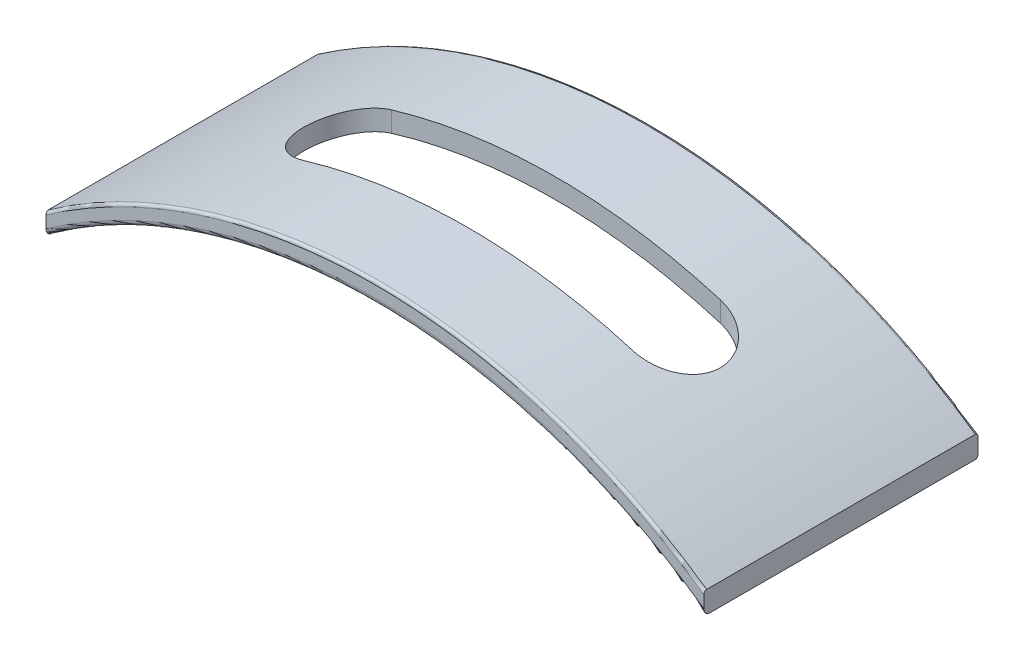
ISO-10303-21;
HEADER;
FILE_DESCRIPTION(('STEP AP214'),'2;1');
FILE_NAME('part.step','',(''),(''),'','','');
FILE_SCHEMA(('AUTOMOTIVE_DESIGN { 1 0 10303 214 1 1 1 1 }'));
ENDSEC;
DATA;
#1=APPLICATION_CONTEXT('core data for automotive mechanical design processes');
#2=APPLICATION_PROTOCOL_DEFINITION('international standard','automotive_design',2000,#1);
#3=PRODUCT_CONTEXT('',#1,'mechanical');
#4=PRODUCT('Part','Part','',(#3));
#5=PRODUCT_RELATED_PRODUCT_CATEGORY('part','',(#4));
#6=PRODUCT_DEFINITION_FORMATION('','',#4);
#7=PRODUCT_DEFINITION_CONTEXT('part definition',#1,'design');
#8=PRODUCT_DEFINITION('design','',#6,#7);
#9=PRODUCT_DEFINITION_SHAPE('','',#8);
#10=(LENGTH_UNIT() NAMED_UNIT(*) SI_UNIT(.MILLI.,.METRE.));
#11=(NAMED_UNIT(*) PLANE_ANGLE_UNIT() SI_UNIT($,.RADIAN.));
#12=(NAMED_UNIT(*) SI_UNIT($,.STERADIAN.) SOLID_ANGLE_UNIT());
#13=UNCERTAINTY_MEASURE_WITH_UNIT(LENGTH_MEASURE(1.E-05),#10,'distance_accuracy_value','');
#14=(GEOMETRIC_REPRESENTATION_CONTEXT(3) GLOBAL_UNCERTAINTY_ASSIGNED_CONTEXT((#13)) GLOBAL_UNIT_ASSIGNED_CONTEXT((#10,
#11,#12)) REPRESENTATION_CONTEXT('',''));
#15=CARTESIAN_POINT('',(0.,0.,0.));
#16=DIRECTION('',(0.,0.,1.));
#17=DIRECTION('',(1.,0.,0.));
#18=AXIS2_PLACEMENT_3D('',#15,#16,#17);
#19=CARTESIAN_POINT('',(0.,-43.9013111687743,25.));
#20=DIRECTION('',(0.,0.,-1.));
#21=DIRECTION('',(-1.,0.,0.));
#22=AXIS2_PLACEMENT_3D('',#19,#20,#21);
#23=CYLINDRICAL_SURFACE('',#22,51.5336771214945);
#24=DIRECTION('',(0.,0.,-1.));
#25=VECTOR('',#24,1.);
#26=CARTESIAN_POINT('',(-30.,-2.,25.));
#27=LINE('',#26,#25);
#28=CARTESIAN_POINT('',(-30.,-2.,24.5));
#29=VERTEX_POINT('',#28);
#30=CARTESIAN_POINT('',(-30.,-2.,0.25));
#31=VERTEX_POINT('',#30);
#32=EDGE_CURVE('E299',#29,#31,#27,.T.);
#33=ORIENTED_EDGE('',*,*,#32,.T.);
#34=CARTESIAN_POINT('',(0.,-43.9013111687743,0.25));
#35=DIRECTION('',(0.,0.,-1.));
#36=DIRECTION('',(-1.,0.,0.));
#37=AXIS2_PLACEMENT_3D('',#34,#35,#36);
#38=CIRCLE('',#37,51.5336771214945);
#39=CARTESIAN_POINT('',(30.,-2.,0.25));
#40=VERTEX_POINT('',#39);
#41=EDGE_CURVE('E261',#31,#40,#38,.T.);
#42=ORIENTED_EDGE('',*,*,#41,.T.);
#43=DIRECTION('',(0.,0.,-1.));
#44=VECTOR('',#43,1.);
#45=CARTESIAN_POINT('',(30.,-2.,25.));
#46=LINE('',#45,#44);
#47=CARTESIAN_POINT('',(30.,-2.,24.5));
#48=VERTEX_POINT('',#47);
#49=EDGE_CURVE('E302',#48,#40,#46,.T.);
#50=ORIENTED_EDGE('',*,*,#49,.F.);
#51=CARTESIAN_POINT('',(0.,-43.9013111687743,24.5));
#52=DIRECTION('',(0.,0.,-1.));
#53=DIRECTION('',(-1.,0.,0.));
#54=AXIS2_PLACEMENT_3D('',#51,#52,#53);
#55=CIRCLE('',#54,51.5336771214945);
#56=EDGE_CURVE('E269',#48,#29,#55,.F.);
#57=ORIENTED_EDGE('',*,*,#56,.T.);
#58=EDGE_LOOP('',(#33,#42,#50,#57));
#59=FACE_BOUND('',#58,.T.);
#60=CARTESIAN_POINT('',(-15.,5.40102019255637,16.5));
#61=CARTESIAN_POINT('',(-15.1179513128015,5.3651385071772,16.5000076195144));
#62=CARTESIAN_POINT('',(-15.2357618215816,5.32882841759186,16.4947828579675));
#63=CARTESIAN_POINT('',(-15.4702791286443,5.25563457535611,16.474000372818));
#64=CARTESIAN_POINT('',(-15.5869860102367,5.21875086657156,16.4584434355809));
#65=CARTESIAN_POINT('',(-15.8185034940739,5.14468375880668,16.4171263376553));
#66=CARTESIAN_POINT('',(-15.9333139095254,5.10750033083576,16.3913651780659));
#67=CARTESIAN_POINT('',(-16.1601979833847,5.03315686130002,16.3298528576106));
#68=CARTESIAN_POINT('',(-16.2722716276293,4.9959968198572,16.2941016450558));
#69=CARTESIAN_POINT('',(-16.6032999979632,4.88500068203661,16.1721429084369));
#70=CARTESIAN_POINT('',(-16.8171931041762,4.8116065393354,16.0712068043143));
#71=CARTESIAN_POINT('',(-17.2247623709842,4.6689905295129,15.8326034417193));
#72=CARTESIAN_POINT('',(-17.4184432375198,4.59976769279513,15.6949447598909));
#73=CARTESIAN_POINT('',(-17.7780067476244,4.46911982886023,15.387564087263));
#74=CARTESIAN_POINT('',(-17.944146618091,4.40762411776207,15.2181744780298));
#75=CARTESIAN_POINT('',(-18.2451571690101,4.29474720840848,14.8506043341167));
#76=CARTESIAN_POINT('',(-18.3800341696418,4.24336396610895,14.6524296319027));
#77=CARTESIAN_POINT('',(-18.6070102122771,4.15608277076029,14.2438980201352));
#78=CARTESIAN_POINT('',(-18.7009848538227,4.11951293215671,14.0347286389881));
#79=CARTESIAN_POINT('',(-18.8521275206658,4.06038012672537,13.6016502280125));
#80=CARTESIAN_POINT('',(-18.9093151677787,4.03780969298509,13.3777491263076));
#81=CARTESIAN_POINT('',(-18.9818675032768,4.00912610131467,12.9373395649319));
#82=CARTESIAN_POINT('',(-18.9997170536988,4.00203543949093,12.7213016234105));
#83=CARTESIAN_POINT('',(-19.0002760633806,4.00181399818526,12.2891930103569));
#84=CARTESIAN_POINT('',(-18.9829925271415,4.00868043606935,12.0731223539349));
#85=CARTESIAN_POINT('',(-18.9150935653052,4.03552599729484,11.6539763490636));
#86=CARTESIAN_POINT('',(-18.8655116303226,4.05509848535575,11.4507056478134));
#87=CARTESIAN_POINT('',(-18.7359243709711,4.10587394803192,11.0556683336362));
#88=CARTESIAN_POINT('',(-18.6559164976627,4.137077897071,10.8639026861063));
#89=CARTESIAN_POINT('',(-18.465931605464,4.21043189114839,10.4920191604687));
#90=CARTESIAN_POINT('',(-18.3552667325218,4.25283197633725,10.3123030817034));
#91=CARTESIAN_POINT('',(-18.1084548409614,4.3461873717434,9.97385523321495));
#92=CARTESIAN_POINT('',(-17.9723027945751,4.39714436974926,9.81512761437392));
#93=CARTESIAN_POINT('',(-17.669501132361,4.50877172270009,9.51299413064383));
#94=CARTESIAN_POINT('',(-17.5015117970534,4.56984143709118,9.37107902119877));
#95=CARTESIAN_POINT('',(-17.1457806904962,4.69681372299764,9.11718752515325));
#96=CARTESIAN_POINT('',(-16.9580264401537,4.7627193397341,9.00523021308318));
#97=CARTESIAN_POINT('',(-16.5560627902116,4.90098829826317,8.80788288806468));
#98=CARTESIAN_POINT('',(-16.3409463156995,4.97350329139957,8.72444816459542));
#99=CARTESIAN_POINT('',(-15.8998612232281,5.11876617057284,8.59578739251293));
#100=CARTESIAN_POINT('',(-15.6739084455045,5.19151357981918,8.550507267641));
#101=CARTESIAN_POINT('',(-15.3717473346871,5.28644494241938,8.51661317861545));
#102=CARTESIAN_POINT('',(-15.2975316331139,5.30957674865355,8.51038379551611));
#103=CARTESIAN_POINT('',(-15.1489041169419,5.3555319776657,8.50208246870267));
#104=CARTESIAN_POINT('',(-15.074492809668,5.37835583655531,8.50000385518851));
#105=CARTESIAN_POINT('',(-15.,5.40102019255637,8.5));
#106=B_SPLINE_CURVE_WITH_KNOTS('',3,(#60,#61,#62,#63,#64,#65,#66,#67,#68,#69,#70,#71,#72,#73,
#74,#75,#76,#77,#78,#79,#80,#81,#82,#83,#84,#85,#86,#87,#88,#89,#90,#91,#92,#93,#94,#95,#96,#97,
#98,#99,#100,#101,#102,#103,#104,#105),.UNSPECIFIED.,.F.,.F.,(4,2,2,2,2,2,2,2,2,2,2,2,2,2,2,2,2,
2,2,2,2,2,4),(0.,0.369737100535955,0.739446064196842,1.10919122796826,1.47893830485236,
2.21801914778329,2.9569275275475,3.68848964832294,4.41990374544917,5.11287996067117,
5.80548624213657,6.45291217951321,7.10020905191514,7.7277484990439,8.3553405300106,
8.9983479583802,9.64148236456199,10.3232054110685,11.0053614924422,11.7277321167672,
12.4490771997026,12.682955724327,12.9164581301917),.UNSPECIFIED.);
#107=CARTESIAN_POINT('',(-15.,5.40102019255637,16.5));
#108=VERTEX_POINT('',#107);
#109=CARTESIAN_POINT('',(-15.,5.40102019255637,8.5));
#110=VERTEX_POINT('',#109);
#111=EDGE_CURVE('E139',#108,#110,#106,.T.);
#112=ORIENTED_EDGE('',*,*,#111,.F.);
#113=CARTESIAN_POINT('',(0.,-43.9013111687743,16.5));
#114=DIRECTION('',(0.,0.,-1.));
#115=DIRECTION('',(-1.,0.,0.));
#116=AXIS2_PLACEMENT_3D('',#113,#114,#115);
#117=CIRCLE('',#116,51.5336771214945);
#118=CARTESIAN_POINT('',(15.,5.40102019255637,16.5));
#119=VERTEX_POINT('',#118);
#120=EDGE_CURVE('E174',#119,#108,#117,.F.);
#121=ORIENTED_EDGE('',*,*,#120,.F.);
#122=CARTESIAN_POINT('',(15.,5.40102019255637,8.5));
#123=CARTESIAN_POINT('',(15.1179513128014,5.3651385071772,8.49999238048558));
#124=CARTESIAN_POINT('',(15.2357618215816,5.32882841759186,8.50521714203254));
#125=CARTESIAN_POINT('',(15.4702791286443,5.25563457535612,8.52599962718201));
#126=CARTESIAN_POINT('',(15.5869860102367,5.21875086657156,8.54155656441915));
#127=CARTESIAN_POINT('',(15.8185034940739,5.14468375880668,8.58287366234468));
#128=CARTESIAN_POINT('',(15.9333139095254,5.10750033083576,8.60863482193413));
#129=CARTESIAN_POINT('',(16.1601979833847,5.03315686130002,8.67014714238941));
#130=CARTESIAN_POINT('',(16.2722716276293,4.99599681985721,8.70589835494421));
#131=CARTESIAN_POINT('',(16.6032999979632,4.88500068203661,8.82785709156315));
#132=CARTESIAN_POINT('',(16.8171931041762,4.8116065393354,8.9287931956857));
#133=CARTESIAN_POINT('',(17.2247623709842,4.6689905295129,9.16739655828067));
#134=CARTESIAN_POINT('',(17.4184432375198,4.59976769279513,9.30505524010911));
#135=CARTESIAN_POINT('',(17.7780067476244,4.46911982886023,9.61243591273701));
#136=CARTESIAN_POINT('',(17.944146618091,4.40762411776207,9.78182552197016));
#137=CARTESIAN_POINT('',(18.2451571690101,4.29474720840848,10.1493956658833));
#138=CARTESIAN_POINT('',(18.3800341696418,4.24336396610894,10.3475703680973));
#139=CARTESIAN_POINT('',(18.6070102122771,4.15608277076029,10.7561019798648));
#140=CARTESIAN_POINT('',(18.7009848538227,4.11951293215672,10.9652713610119));
#141=CARTESIAN_POINT('',(18.8521275206658,4.06038012672539,11.3983497719875));
#142=CARTESIAN_POINT('',(18.9093151677787,4.03780969298511,11.6222508736924));
#143=CARTESIAN_POINT('',(18.9818675032768,4.00912610131468,12.0626604350681));
#144=CARTESIAN_POINT('',(18.9997170536988,4.00203543949092,12.2786983765895));
#145=CARTESIAN_POINT('',(19.0002760633805,4.00181399818526,12.7108069896431));
#146=CARTESIAN_POINT('',(18.9829925271415,4.00868043606935,12.9268776460651));
#147=CARTESIAN_POINT('',(18.9150935653052,4.03552599729485,13.3460236509364));
#148=CARTESIAN_POINT('',(18.8655116303226,4.05509848535575,13.5492943521866));
#149=CARTESIAN_POINT('',(18.7359243709711,4.10587394803192,13.9443316663638));
#150=CARTESIAN_POINT('',(18.6559164976627,4.13707789707099,14.1360973138937));
#151=CARTESIAN_POINT('',(18.465931605464,4.21043189114839,14.5079808395313));
#152=CARTESIAN_POINT('',(18.3552667325218,4.25283197633725,14.6876969182966));
#153=CARTESIAN_POINT('',(18.1084548409614,4.3461873717434,15.0261447667851));
#154=CARTESIAN_POINT('',(17.9723027945751,4.39714436974925,15.1848723856261));
#155=CARTESIAN_POINT('',(17.669501132361,4.50877172270009,15.4870058693562));
#156=CARTESIAN_POINT('',(17.5015117970534,4.56984143709119,15.6289209788012));
#157=CARTESIAN_POINT('',(17.1457806904962,4.69681372299765,15.8828124748468));
#158=CARTESIAN_POINT('',(16.9580264401536,4.7627193397341,15.9947697869168));
#159=CARTESIAN_POINT('',(16.5560627902115,4.90098829826317,16.1921171119353));
#160=CARTESIAN_POINT('',(16.3409463156995,4.97350329139957,16.2755518354046));
#161=CARTESIAN_POINT('',(15.899861223228,5.11876617057285,16.4042126074871));
#162=CARTESIAN_POINT('',(15.6739084455045,5.1915135798192,16.449492732359));
#163=CARTESIAN_POINT('',(15.3717473346871,5.28644494241939,16.4833868213845));
#164=CARTESIAN_POINT('',(15.2975316331139,5.30957674865355,16.4896162044839));
#165=CARTESIAN_POINT('',(15.1489041169419,5.35553197766569,16.4979175312973));
#166=CARTESIAN_POINT('',(15.074492809668,5.37835583655531,16.4999961448115));
#167=CARTESIAN_POINT('',(15.,5.40102019255637,16.5));
#168=B_SPLINE_CURVE_WITH_KNOTS('',3,(#122,#123,#124,#125,#126,#127,#128,#129,#130,#131,#132,
#133,#134,#135,#136,#137,#138,#139,#140,#141,#142,#143,#144,#145,#146,#147,#148,#149,#150,#151,
#152,#153,#154,#155,#156,#157,#158,#159,#160,#161,#162,#163,#164,#165,#166,#167),.UNSPECIFIED.,
.F.,.F.,(4,2,2,2,2,2,2,2,2,2,2,2,2,2,2,2,2,2,2,2,2,2,4),(0.,0.369737100535957,0.739446064196845,
1.10919122796826,1.47893830485236,2.21801914778329,2.9569275275475,3.68848964832294,
4.41990374544917,5.11287996067117,5.80548624213658,6.45291217951322,7.10020905191514,
7.7277484990439,8.3553405300106,8.9983479583802,9.64148236456199,10.3232054110685,
11.0053614924422,11.7277321167672,12.4490771997026,12.682955724327,12.9164581301917),.UNSPECIFIED.);
#169=CARTESIAN_POINT('',(15.,5.40102019255637,8.5));
#170=VERTEX_POINT('',#169);
#171=EDGE_CURVE('E166',#170,#119,#168,.T.);
#172=ORIENTED_EDGE('',*,*,#171,.F.);
#173=CARTESIAN_POINT('',(0.,-43.9013111687743,8.5));
#174=DIRECTION('',(0.,0.,1.));
#175=DIRECTION('',(1.,0.,0.));
#176=AXIS2_PLACEMENT_3D('',#173,#174,#175);
#177=CIRCLE('',#176,51.5336771214945);
#178=EDGE_CURVE('E175',#110,#170,#177,.F.);
#179=ORIENTED_EDGE('',*,*,#178,.F.);
#180=EDGE_LOOP('',(#112,#121,#172,#179));
#181=FACE_BOUND('',#180,.T.);
#182=ADVANCED_FACE('F34',(#59,#181),#23,.F.);
#183=CARTESIAN_POINT('',(0.,-42.9013111687743,25.));
#184=DIRECTION('',(0.,0.,-1.));
#185=DIRECTION('',(-1.,0.,0.));
#186=AXIS2_PLACEMENT_3D('',#183,#184,#185);
#187=CYLINDRICAL_SURFACE('',#186,52.35);
#188=DIRECTION('',(0.,0.,-1.));
#189=VECTOR('',#188,1.);
#190=CARTESIAN_POINT('',(30.,0.,25.));
#191=LINE('',#190,#189);
#192=CARTESIAN_POINT('',(30.,0.,24.75));
#193=VERTEX_POINT('',#192);
#194=CARTESIAN_POINT('',(30.,0.,0.25));
#195=VERTEX_POINT('',#194);
#196=EDGE_CURVE('E305',#193,#195,#191,.T.);
#197=ORIENTED_EDGE('',*,*,#196,.T.);
#198=CARTESIAN_POINT('',(0.,-42.9013111687743,0.25));
#199=DIRECTION('',(0.,0.,-1.));
#200=DIRECTION('',(-1.,0.,0.));
#201=AXIS2_PLACEMENT_3D('',#198,#199,#200);
#202=CIRCLE('',#201,52.35);
#203=CARTESIAN_POINT('',(-30.,0.,0.25));
#204=VERTEX_POINT('',#203);
#205=EDGE_CURVE('E132',#195,#204,#202,.F.);
#206=ORIENTED_EDGE('',*,*,#205,.T.);
#207=DIRECTION('',(0.,0.,-1.));
#208=VECTOR('',#207,1.);
#209=CARTESIAN_POINT('',(-30.,0.,25.));
#210=LINE('',#209,#208);
#211=CARTESIAN_POINT('',(-30.,0.,24.75));
#212=VERTEX_POINT('',#211);
#213=EDGE_CURVE('E308',#212,#204,#210,.T.);
#214=ORIENTED_EDGE('',*,*,#213,.F.);
#215=CARTESIAN_POINT('',(0.,-42.9013111687743,24.75));
#216=DIRECTION('',(0.,0.,-1.));
#217=DIRECTION('',(-1.,0.,0.));
#218=AXIS2_PLACEMENT_3D('',#215,#216,#217);
#219=CIRCLE('',#218,52.35);
#220=EDGE_CURVE('E296',#212,#193,#219,.T.);
#221=ORIENTED_EDGE('',*,*,#220,.T.);
#222=EDGE_LOOP('',(#197,#206,#214,#221));
#223=FACE_BOUND('',#222,.T.);
#224=CARTESIAN_POINT('',(-15.,7.25367362835229,16.5));
#225=CARTESIAN_POINT('',(-15.1177662295475,7.21845727385717,16.5000077369327));
#226=CARTESIAN_POINT('',(-15.2353966425088,7.18282107467261,16.4947992170551));
#227=CARTESIAN_POINT('',(-15.4695647117981,7.11098683505444,16.4740795931386));
#228=CARTESIAN_POINT('',(-15.586102449355,7.07478883692449,16.4585692611891));
#229=CARTESIAN_POINT('',(-15.8172903299807,7.00210084851292,16.4173744096841));
#230=CARTESIAN_POINT('',(-15.9319403353982,6.96561083722381,16.391689151577));
#231=CARTESIAN_POINT('',(-16.1585156830092,6.8926550037456,16.3303567972174));
#232=CARTESIAN_POINT('',(-16.2704410128323,6.85618918166705,16.2947096557455));
#233=CARTESIAN_POINT('',(-16.6010443305924,6.7472680498697,16.1731046606415));
#234=CARTESIAN_POINT('',(-16.8146790139807,6.67524826316351,16.0724600732267));
#235=CARTESIAN_POINT('',(-17.2217879603538,6.53530486551717,15.8345605826625));
#236=CARTESIAN_POINT('',(-17.4152669325004,6.46738029934281,15.6973142579069));
#237=CARTESIAN_POINT('',(-17.7745688125356,6.3391524314441,15.3908390620622));
#238=CARTESIAN_POINT('',(-17.940639551984,6.27878218214066,15.2219301097211));
#239=CARTESIAN_POINT('',(-18.2416141262636,6.16794417405732,14.855445144411));
#240=CARTESIAN_POINT('',(-18.3765237907843,6.11747456330859,14.6578745048183));
#241=CARTESIAN_POINT('',(-18.6039287155708,6.03160632794027,14.2502490745069));
#242=CARTESIAN_POINT('',(-18.6982292294925,5.99557277228383,14.0413369262851));
#243=CARTESIAN_POINT('',(-18.8500753010702,5.93723770273884,13.6087760487645));
#244=CARTESIAN_POINT('',(-18.9076397606113,5.91492912711809,13.385134963436));
#245=CARTESIAN_POINT('',(-18.9810710653933,5.88642181017441,12.9446954588165));
#246=CARTESIAN_POINT('',(-18.999338705724,5.87929579677089,12.7283550205091));
#247=CARTESIAN_POINT('',(-19.000625511459,5.87879485892706,12.2955726600342));
#248=CARTESIAN_POINT('',(-18.9836515273231,5.88541726199424,12.079130765765));
#249=CARTESIAN_POINT('',(-18.9162076045138,5.91160528621169,11.6590192634355));
#250=CARTESIAN_POINT('',(-18.8667485217829,5.93078024502547,11.4551612424829));
#251=CARTESIAN_POINT('',(-18.7372144490171,5.98062900430517,11.0589290365694));
#252=CARTESIAN_POINT('',(-18.6571370078543,6.01130372537142,10.8665557724372));
#253=CARTESIAN_POINT('',(-18.4669053309031,6.08344613755605,10.4936578684231));
#254=CARTESIAN_POINT('',(-18.3560879202912,6.1251507340676,10.3135183801962));
#255=CARTESIAN_POINT('',(-18.1088142359312,6.21702256606212,9.97425920131242));
#256=CARTESIAN_POINT('',(-17.9723530753665,6.2671914143538,9.81514352693066));
#257=CARTESIAN_POINT('',(-17.6690640993632,6.37702194142152,9.51259437989185));
#258=CARTESIAN_POINT('',(-17.5009343315949,6.43706537108566,9.37060513359238));
#259=CARTESIAN_POINT('',(-17.1448618162441,6.56192568538753,9.11659376493441));
#260=CARTESIAN_POINT('',(-16.9569067329996,6.62674553434836,9.00459045551955));
#261=CARTESIAN_POINT('',(-16.5548547319543,6.76262766963634,8.80738562140757));
#262=CARTESIAN_POINT('',(-16.3398779493929,6.83383506564379,8.72407945763716));
#263=CARTESIAN_POINT('',(-15.8990966826855,6.97648610931583,8.59562152978405));
#264=CARTESIAN_POINT('',(-15.6733080257507,7.0479292772151,8.55041569345229));
#265=CARTESIAN_POINT('',(-15.371394275675,7.14115877918706,8.5165814811342));
#266=CARTESIAN_POINT('',(-15.2972465791352,7.16387437810743,8.51036384926977));
#267=CARTESIAN_POINT('',(-15.1487588115094,7.20900306274022,8.50207837310206));
#268=CARTESIAN_POINT('',(-15.0744192425733,7.23141657673938,8.50000386156846));
#269=CARTESIAN_POINT('',(-15.,7.25367362835229,8.5));
#270=B_SPLINE_CURVE_WITH_KNOTS('',3,(#224,#225,#226,#227,#228,#229,#230,#231,#232,#233,#234,
#235,#236,#237,#238,#239,#240,#241,#242,#243,#244,#245,#246,#247,#248,#249,#250,#251,#252,#253,
#254,#255,#256,#257,#258,#259,#260,#261,#262,#263,#264,#265,#266,#267,#268,#269),.UNSPECIFIED.,
.F.,.F.,(4,2,2,2,2,2,2,2,2,2,2,2,2,2,2,2,2,2,2,2,2,2,4),(0.,0.368629780899466,0.737231937235737,
1.10586085363013,1.4744914433462,2.21134493727803,2.94802588549739,3.67762963876221,
4.40709678522882,5.0995386249978,5.79162389323564,6.44006119464698,7.08837246106607,
7.71740908839029,8.34649608327975,8.99038079879737,9.63438834125302,10.3157368797932,
10.9975118946437,11.7182128586042,12.4378892681486,12.6712033624403,12.904141697367),.UNSPECIFIED.);
#271=CARTESIAN_POINT('',(-15.,7.25367362835229,16.5));
#272=VERTEX_POINT('',#271);
#273=CARTESIAN_POINT('',(-15.,7.25367362835229,8.5));
#274=VERTEX_POINT('',#273);
#275=EDGE_CURVE('E11',#272,#274,#270,.T.);
#276=ORIENTED_EDGE('',*,*,#275,.T.);
#277=CARTESIAN_POINT('',(0.,-42.9013111687743,8.5));
#278=DIRECTION('',(0.,0.,1.));
#279=DIRECTION('',(1.,0.,0.));
#280=AXIS2_PLACEMENT_3D('',#277,#278,#279);
#281=CIRCLE('',#280,52.35);
#282=CARTESIAN_POINT('',(15.,7.25367362835229,8.5));
#283=VERTEX_POINT('',#282);
#284=EDGE_CURVE('E127',#274,#283,#281,.F.);
#285=ORIENTED_EDGE('',*,*,#284,.T.);
#286=CARTESIAN_POINT('',(15.,7.25367362835229,8.5));
#287=CARTESIAN_POINT('',(15.1177662295475,7.21845727385717,8.49999226306734));
#288=CARTESIAN_POINT('',(15.2353966425088,7.18282107467261,8.50520078294487));
#289=CARTESIAN_POINT('',(15.4695647117981,7.11098683505444,8.52592040686136));
#290=CARTESIAN_POINT('',(15.586102449355,7.07478883692448,8.54143073881087));
#291=CARTESIAN_POINT('',(15.8172903299807,7.00210084851291,8.58262559031589));
#292=CARTESIAN_POINT('',(15.9319403353982,6.9656108372238,8.60831084842301));
#293=CARTESIAN_POINT('',(16.1585156830092,6.8926550037456,8.66964320278262));
#294=CARTESIAN_POINT('',(16.2704410128323,6.85618918166705,8.70529034425447));
#295=CARTESIAN_POINT('',(16.6010443305924,6.74726804986971,8.82689533935851));
#296=CARTESIAN_POINT('',(16.8146790139807,6.67524826316352,8.92753992677328));
#297=CARTESIAN_POINT('',(17.2217879603538,6.53530486551718,9.16543941733748));
#298=CARTESIAN_POINT('',(17.4152669325004,6.46738029934281,9.30268574209305));
#299=CARTESIAN_POINT('',(17.7745688125355,6.3391524314441,9.60916093793781));
#300=CARTESIAN_POINT('',(17.940639551984,6.27878218214066,9.77806989027886));
#301=CARTESIAN_POINT('',(18.2416141262636,6.16794417405732,10.144554855589));
#302=CARTESIAN_POINT('',(18.3765237907843,6.11747456330859,10.3421254951817));
#303=CARTESIAN_POINT('',(18.6039287155708,6.03160632794026,10.7497509254931));
#304=CARTESIAN_POINT('',(18.6982292294925,5.99557277228383,10.9586630737149));
#305=CARTESIAN_POINT('',(18.8500753010702,5.93723770273884,11.3912239512355));
#306=CARTESIAN_POINT('',(18.9076397606113,5.9149291271181,11.614865036564));
#307=CARTESIAN_POINT('',(18.9810710653932,5.88642181017442,12.0553045411835));
#308=CARTESIAN_POINT('',(18.999338705724,5.87929579677089,12.2716449794909));
#309=CARTESIAN_POINT('',(19.000625511459,5.87879485892705,12.7044273399658));
#310=CARTESIAN_POINT('',(18.9836515273231,5.88541726199424,12.920869234235));
#311=CARTESIAN_POINT('',(18.9162076045138,5.91160528621169,13.3409807365645));
#312=CARTESIAN_POINT('',(18.8667485217829,5.93078024502547,13.5448387575171));
#313=CARTESIAN_POINT('',(18.7372144490171,5.98062900430517,13.9410709634306));
#314=CARTESIAN_POINT('',(18.6571370078543,6.01130372537142,14.1334442275628));
#315=CARTESIAN_POINT('',(18.4669053309031,6.08344613755605,14.5063421315769));
#316=CARTESIAN_POINT('',(18.3560879202912,6.12515073406761,14.6864816198038));
#317=CARTESIAN_POINT('',(18.1088142359312,6.21702256606213,15.0257407986876));
#318=CARTESIAN_POINT('',(17.9723530753665,6.2671914143538,15.1848564730693));
#319=CARTESIAN_POINT('',(17.6690640993632,6.37702194142152,15.4874056201082));
#320=CARTESIAN_POINT('',(17.5009343315949,6.43706537108566,15.6293948664076));
#321=CARTESIAN_POINT('',(17.1448618162441,6.56192568538752,15.8834062350656));
#322=CARTESIAN_POINT('',(16.9569067329996,6.62674553434836,15.9954095444805));
#323=CARTESIAN_POINT('',(16.5548547319543,6.76262766963634,16.1926143785924));
#324=CARTESIAN_POINT('',(16.3398779493929,6.83383506564379,16.2759205423628));
#325=CARTESIAN_POINT('',(15.8990966826855,6.97648610931582,16.404378470216));
#326=CARTESIAN_POINT('',(15.6733080257506,7.0479292772151,16.4495843065477));
#327=CARTESIAN_POINT('',(15.371394275675,7.14115877918706,16.4834185188658));
#328=CARTESIAN_POINT('',(15.2972465791352,7.16387437810743,16.4896361507302));
#329=CARTESIAN_POINT('',(15.1487588115094,7.20900306274022,16.4979216268979));
#330=CARTESIAN_POINT('',(15.0744192425733,7.23141657673938,16.4999961384315));
#331=CARTESIAN_POINT('',(15.,7.25367362835228,16.5));
#332=B_SPLINE_CURVE_WITH_KNOTS('',3,(#286,#287,#288,#289,#290,#291,#292,#293,#294,#295,#296,
#297,#298,#299,#300,#301,#302,#303,#304,#305,#306,#307,#308,#309,#310,#311,#312,#313,#314,#315,
#316,#317,#318,#319,#320,#321,#322,#323,#324,#325,#326,#327,#328,#329,#330,#331),.UNSPECIFIED.,
.F.,.F.,(4,2,2,2,2,2,2,2,2,2,2,2,2,2,2,2,2,2,2,2,2,2,4),(0.,0.368629780899464,0.737231937235736,
1.10586085363013,1.4744914433462,2.21134493727803,2.94802588549739,3.67762963876221,
4.40709678522882,5.0995386249978,5.79162389323564,6.44006119464699,7.08837246106607,
7.7174090883903,8.34649608327976,8.99038079879737,9.63438834125303,10.3157368797932,
10.9975118946437,11.7182128586042,12.4378892681486,12.6712033624403,12.904141697367),.UNSPECIFIED.);
#333=CARTESIAN_POINT('',(15.,7.25367362835229,16.5));
#334=VERTEX_POINT('',#333);
#335=EDGE_CURVE('E131',#283,#334,#332,.T.);
#336=ORIENTED_EDGE('',*,*,#335,.T.);
#337=CARTESIAN_POINT('',(0.,-42.9013111687743,16.5));
#338=DIRECTION('',(0.,0.,-1.));
#339=DIRECTION('',(-1.,0.,0.));
#340=AXIS2_PLACEMENT_3D('',#337,#338,#339);
#341=CIRCLE('',#340,52.35);
#342=EDGE_CURVE('E49',#334,#272,#341,.F.);
#343=ORIENTED_EDGE('',*,*,#342,.T.);
#344=EDGE_LOOP('',(#276,#285,#336,#343));
#345=FACE_BOUND('',#344,.T.);
#346=ADVANCED_FACE('F143',(#223,#345),#187,.T.);
#347=CARTESIAN_POINT('',(-30.,0.,25.));
#348=DIRECTION('',(1.,0.,0.));
#349=DIRECTION('',(0.,0.,-1.));
#350=AXIS2_PLACEMENT_3D('',#347,#348,#349);
#351=PLANE('',#350);
#352=DIRECTION('',(0.,-1.,0.));
#353=VECTOR('',#352,1.);
#354=CARTESIAN_POINT('',(-30.,0.,0.));
#355=LINE('',#354,#353);
#356=CARTESIAN_POINT('',(-30.,-0.305419348083438,0.));
#357=VERTEX_POINT('',#356);
#358=CARTESIAN_POINT('',(-30.,-1.69290896941123,0.));
#359=VERTEX_POINT('',#358);
#360=EDGE_CURVE('E193',#357,#359,#355,.T.);
#361=ORIENTED_EDGE('',*,*,#360,.T.);
#362=CARTESIAN_POINT('',(-30.,-1.69290896941123,0.));
#363=CARTESIAN_POINT('',(-30.,-1.71403126472855,5.97848446081241E-06));
#364=CARTESIAN_POINT('',(-30.,-1.73518391452564,0.001780331731595));
#365=CARTESIAN_POINT('',(-30.,-1.77708687036157,0.00895301392430915));
#366=CARTESIAN_POINT('',(-30.,-1.79783074125928,0.0143886821122921));
#367=CARTESIAN_POINT('',(-30.,-1.83742359130012,0.0287688773187993));
#368=CARTESIAN_POINT('',(-30.,-1.85630941582064,0.0376106257962954));
#369=CARTESIAN_POINT('',(-30.,-1.89191443849813,0.0588195664433272));
#370=CARTESIAN_POINT('',(-30.,-1.90864415408949,0.0711686242103153));
#371=CARTESIAN_POINT('',(-30.,-1.93382740493171,0.0945438364993946));
#372=CARTESIAN_POINT('',(-30.,-1.94317143866037,0.104616618832165));
#373=CARTESIAN_POINT('',(-30.,-1.96009878069187,0.126168191346395));
#374=CARTESIAN_POINT('',(-30.,-1.96768188117484,0.13764714723616));
#375=CARTESIAN_POINT('',(-30.,-1.98073090734252,0.161879691124524));
#376=CARTESIAN_POINT('',(-30.,-1.98617935949235,0.174642766285946));
#377=CARTESIAN_POINT('',(-30.,-1.99448949871394,0.200973031879507));
#378=CARTESIAN_POINT('',(-30.,-1.99735813371331,0.214537957003309));
#379=CARTESIAN_POINT('',(-30.,-1.99922116057704,0.231844969994101));
#380=CARTESIAN_POINT('',(-30.,-1.99951319229618,0.235472249702534));
#381=CARTESIAN_POINT('',(-30.,-1.99990229226449,0.242732423960669));
#382=CARTESIAN_POINT('',(-30.,-1.99999961904576,0.246365304646196));
#383=CARTESIAN_POINT('',(-30.,-2.00000000000001,0.25));
#384=B_SPLINE_CURVE_WITH_KNOTS('',3,(#362,#363,#364,#365,#366,#367,#368,#369,#370,#371,#372,
#373,#374,#375,#376,#377,#378,#379,#380,#381,#382,#383),.UNSPECIFIED.,.F.,.F.,(4,2,2,2,2,2,2,2,
2,2,4),(0.,0.0633446744857195,0.12734534012809,0.189549473938919,0.251437662799814,
0.292498549652855,0.333564279924587,0.374959468232529,0.416242834802276,0.427156501330354,
0.438055666885542),.UNSPECIFIED.);
#385=EDGE_CURVE('E230',#359,#31,#384,.T.);
#386=ORIENTED_EDGE('',*,*,#385,.T.);
#387=ORIENTED_EDGE('',*,*,#32,.F.);
#388=CARTESIAN_POINT('',(-30.,-2.,24.5));
#389=CARTESIAN_POINT('',(-30.,-2.00004366950051,24.5244312192474));
#390=CARTESIAN_POINT('',(-30.,-1.99780086277114,24.5488246417731));
#391=CARTESIAN_POINT('',(-30.,-1.98910479975821,24.5967122213552));
#392=CARTESIAN_POINT('',(-30.,-1.98267548491441,24.62021069245));
#393=CARTESIAN_POINT('',(-30.,-1.96597369003626,24.6657443518245));
#394=CARTESIAN_POINT('',(-30.,-1.95570676472171,24.6877816011179));
#395=CARTESIAN_POINT('',(-30.,-1.93184763634013,24.7299917286309));
#396=CARTESIAN_POINT('',(-30.,-1.91825137817409,24.7501622916467));
#397=CARTESIAN_POINT('',(-30.,-1.88727217544179,24.7896110194852));
#398=CARTESIAN_POINT('',(-30.,-1.86969484226129,24.8087356764899));
#399=CARTESIAN_POINT('',(-30.,-1.83202447996002,24.8443010616234));
#400=CARTESIAN_POINT('',(-30.,-1.81193082322188,24.8607411177983));
#401=CARTESIAN_POINT('',(-30.,-1.76602098047783,24.8935552451355));
#402=CARTESIAN_POINT('',(-30.,-1.73982325791653,24.9093949269497));
#403=CARTESIAN_POINT('',(-30.,-1.68545564773548,24.9372477805844));
#404=CARTESIAN_POINT('',(-30.,-1.65728361136131,24.9492567017445));
#405=CARTESIAN_POINT('',(-30.,-1.59426838825622,24.971344892906));
#406=CARTESIAN_POINT('',(-30.,-1.55915572676832,24.9806553233976));
#407=CARTESIAN_POINT('',(-30.,-1.48799075922889,24.9939874289649));
#408=CARTESIAN_POINT('',(-30.,-1.45193986105415,24.9980166093752));
#409=CARTESIAN_POINT('',(-30.,-1.40607082801711,24.9998095646944));
#410=CARTESIAN_POINT('',(-30.,-1.39631676827377,24.9999999711331));
#411=CARTESIAN_POINT('',(-30.,-1.38656602330808,25.));
#412=B_SPLINE_CURVE_WITH_KNOTS('',3,(#388,#389,#390,#391,#392,#393,#394,#395,#396,#397,#398,
#399,#400,#401,#402,#403,#404,#405,#406,#407,#408,#409,#410,#411),.UNSPECIFIED.,.F.,.F.,(4,2,2,
2,2,2,2,2,2,2,2,4),(0.,0.0731312674737756,0.145847948217418,0.218459780796246,0.291160497754282,
0.368795979960731,0.446450864595333,0.537951355844475,0.62955302684125,0.738113202976026,
0.846518933285543,0.875778345190876),.UNSPECIFIED.);
#413=CARTESIAN_POINT('',(-30.,-1.38656602330808,25.));
#414=VERTEX_POINT('',#413);
#415=EDGE_CURVE('E263',#29,#414,#412,.T.);
#416=ORIENTED_EDGE('',*,*,#415,.T.);
#417=DIRECTION('',(0.,-1.,0.));
#418=VECTOR('',#417,1.);
#419=CARTESIAN_POINT('',(-30.,0.,25.));
#420=LINE('',#419,#418);
#421=CARTESIAN_POINT('',(-30.,-0.305419348083438,25.));
#422=VERTEX_POINT('',#421);
#423=EDGE_CURVE('E194',#422,#414,#420,.T.);
#424=ORIENTED_EDGE('',*,*,#423,.F.);
#425=CARTESIAN_POINT('',(-30.,-0.305419348083438,25.));
#426=CARTESIAN_POINT('',(-30.,-0.284290077819054,24.9999951400386));
#427=CARTESIAN_POINT('',(-30.,-0.263128031600782,24.9982076137644));
#428=CARTESIAN_POINT('',(-30.,-0.221219675477677,24.990975204537));
#429=CARTESIAN_POINT('',(-30.,-0.200479844904208,24.9854930440856));
#430=CARTESIAN_POINT('',(-30.,-0.161094986566346,24.9710467963313));
#431=CARTESIAN_POINT('',(-30.,-0.142401016233408,24.9622178631663));
#432=CARTESIAN_POINT('',(-30.,-0.107176250158654,24.9410688478131));
#433=CARTESIAN_POINT('',(-30.,-0.0906349708673579,24.9287666868573));
#434=CARTESIAN_POINT('',(-30.,-0.0656591988210134,24.9054307272086));
#435=CARTESIAN_POINT('',(-30.,-0.0563531615167639,24.8953237827571));
#436=CARTESIAN_POINT('',(-30.,-0.0395115327119638,24.8737075547489));
#437=CARTESIAN_POINT('',(-30.,-0.0319761971340654,24.862198068845));
#438=CARTESIAN_POINT('',(-30.,-0.0190271986675139,24.8379193353868));
#439=CARTESIAN_POINT('',(-30.,-0.0136302670719697,24.8251410954014));
#440=CARTESIAN_POINT('',(-30.,-0.00541032268039868,24.7987940158792));
#441=CARTESIAN_POINT('',(-30.,-0.0025805272817467,24.7852273610375));
#442=CARTESIAN_POINT('',(-30.,-0.000756254598057566,24.7679605597397));
#443=CARTESIAN_POINT('',(-30.,-0.000472675997538595,24.7643718544206));
#444=CARTESIAN_POINT('',(-30.,-9.48610936163389E-05,24.7571893453468));
#445=CARTESIAN_POINT('',(-30.,-3.69546394067839E-07,24.7535955550271));
#446=CARTESIAN_POINT('',(-30.,0.,24.75));
#447=B_SPLINE_CURVE_WITH_KNOTS('',3,(#425,#426,#427,#428,#429,#430,#431,#432,#433,#434,#435,
#436,#437,#438,#439,#440,#441,#442,#443,#444,#445,#446),.UNSPECIFIED.,.F.,.F.,(4,2,2,2,2,2,2,2,
2,2,4),(0.,0.0633683786165557,0.127385887478088,0.18905422479379,0.250410004221601,
0.291467329688398,0.332530585598224,0.373909067731472,0.415177903101056,0.425974391130676,
0.436756295397163),.UNSPECIFIED.);
#448=EDGE_CURVE('E280',#422,#212,#447,.T.);
#449=ORIENTED_EDGE('',*,*,#448,.T.);
#450=ORIENTED_EDGE('',*,*,#213,.T.);
#451=CARTESIAN_POINT('',(-30.,0.,0.25));
#452=CARTESIAN_POINT('',(-30.,2.13762285747168E-05,0.237731360250354));
#453=CARTESIAN_POINT('',(-30.,-0.00110046987450507,0.225480840799708));
#454=CARTESIAN_POINT('',(-30.,-0.00545391092867879,0.201426828619822));
#455=CARTESIAN_POINT('',(-30.,-0.00867394756991637,0.1896212595002));
#456=CARTESIAN_POINT('',(-30.,-0.0170448645313607,0.166741774863605));
#457=CARTESIAN_POINT('',(-30.,-0.0221931459503407,0.155666898039647));
#458=CARTESIAN_POINT('',(-30.,-0.0341651856494518,0.13445578009551));
#459=CARTESIAN_POINT('',(-30.,-0.0409908785893893,0.124320641555556));
#460=CARTESIAN_POINT('',(-30.,-0.0565328111709663,0.104529705075752));
#461=CARTESIAN_POINT('',(-30.,-0.0653433744041416,0.0949483823932701));
#462=CARTESIAN_POINT('',(-30.,-0.0842319957307341,0.0771394009924887));
#463=CARTESIAN_POINT('',(-30.,-0.0943103780833773,0.0689120898251291));
#464=CARTESIAN_POINT('',(-30.,-0.117273369709229,0.0525552045430627));
#465=CARTESIAN_POINT('',(-30.,-0.130342638730488,0.0446851821659342));
#466=CARTESIAN_POINT('',(-30.,-0.157463401902927,0.0308609151683412));
#467=CARTESIAN_POINT('',(-30.,-0.171515948823192,0.0249087633766108));
#468=CARTESIAN_POINT('',(-30.,-0.202890698040024,0.0139997053135277));
#469=CARTESIAN_POINT('',(-30.,-0.220343670210237,0.00941908234822281));
#470=CARTESIAN_POINT('',(-30.,-0.255709169690713,0.00288223672963576));
#471=CARTESIAN_POINT('',(-30.,-0.273621008317373,0.000922291929651908));
#472=CARTESIAN_POINT('',(-30.,-0.296181568649419,8.55377233189972E-05));
#473=CARTESIAN_POINT('',(-30.,-0.300801221687479,3.95227400180531E-09));
#474=CARTESIAN_POINT('',(-30.,-0.305419348083438,0.));
#475=B_SPLINE_CURVE_WITH_KNOTS('',3,(#451,#452,#453,#454,#455,#456,#457,#458,#459,#460,#461,
#462,#463,#464,#465,#466,#467,#468,#469,#470,#471,#472,#473,#474),.UNSPECIFIED.,.F.,.F.,(4,2,2,
2,2,2,2,2,2,2,2,4),(0.,0.0367261488171906,0.0732516752984864,0.109728148556101,
0.146246891417982,0.185149440637096,0.224061959934471,0.269658711288637,0.315305051773023,
0.369229967091138,0.42307821125972,0.436935961642634),.UNSPECIFIED.);
#476=EDGE_CURVE('E231',#204,#357,#475,.T.);
#477=ORIENTED_EDGE('',*,*,#476,.T.);
#478=EDGE_LOOP('',(#361,#386,#387,#416,#424,#449,#450,#477));
#479=FACE_BOUND('',#478,.T.);
#480=ADVANCED_FACE('F184',(#479),#351,.F.);
#481=CARTESIAN_POINT('',(30.,0.,25.));
#482=DIRECTION('',(1.,0.,0.));
#483=DIRECTION('',(0.,0.,-1.));
#484=AXIS2_PLACEMENT_3D('',#481,#482,#483);
#485=PLANE('',#484);
#486=ORIENTED_EDGE('',*,*,#49,.T.);
#487=CARTESIAN_POINT('',(30.,-2.,0.25));
#488=CARTESIAN_POINT('',(30.,-2.00002178440029,0.237787309945124));
#489=CARTESIAN_POINT('',(30.,-1.99890095673387,0.225593435005015));
#490=CARTESIAN_POINT('',(30.,-1.99455482253142,0.201654910110653));
#491=CARTESIAN_POINT('',(30.,-1.99134145075758,0.189908110018024));
#492=CARTESIAN_POINT('',(30.,-1.98299334190308,0.167145809811803));
#493=CARTESIAN_POINT('',(30.,-1.97786136332133,0.156129286379038));
#494=CARTESIAN_POINT('',(30.,-1.96593461558008,0.135028553634909));
#495=CARTESIAN_POINT('',(30.,-1.95913782910856,0.124945496019984));
#496=CARTESIAN_POINT('',(30.,-1.94365288165812,0.105228759267319));
#497=CARTESIAN_POINT('',(30.,-1.93486793046727,0.0956715221807792));
#498=CARTESIAN_POINT('',(30.,-1.91604070800617,0.0778985983211392));
#499=CARTESIAN_POINT('',(30.,-1.90599812075881,0.0696832498928555));
#500=CARTESIAN_POINT('',(30.,-1.8830543221292,0.05328624456337));
#501=CARTESIAN_POINT('',(30.,-1.86996260608597,0.0453714611317452));
#502=CARTESIAN_POINT('',(30.,-1.84279469628397,0.0314523252857662));
#503=CARTESIAN_POINT('',(30.,-1.8287174369527,0.0254500808724064));
#504=CARTESIAN_POINT('',(30.,-1.79721490750434,0.0144000480619454));
#505=CARTESIAN_POINT('',(30.,-1.77965431628697,0.00973810295233444));
#506=CARTESIAN_POINT('',(30.,-1.74406294257942,0.00305242786900257));
#507=CARTESIAN_POINT('',(30.,-1.72603284657372,0.00102504489387919));
#508=CARTESIAN_POINT('',(30.,-1.70294878427863,0.000100430469629286));
#509=CARTESIAN_POINT('',(30.,-1.69792800537855,2.31503902136508E-08));
#510=CARTESIAN_POINT('',(30.,-1.69290896941123,0.));
#511=B_SPLINE_CURVE_WITH_KNOTS('',3,(#487,#488,#489,#490,#491,#492,#493,#494,#495,#496,#497,
#498,#499,#500,#501,#502,#503,#504,#505,#506,#507,#508,#509,#510),.UNSPECIFIED.,.F.,.F.,(4,2,2,
2,2,2,2,2,2,2,2,4),(0.,0.0365570480588913,0.0729073989704448,0.109205686494754,
0.145548177558577,0.184347158611052,0.223155907416669,0.268880234764736,0.314654786532639,
0.368952891660493,0.423175628117945,0.438236464025625),.UNSPECIFIED.);
#512=CARTESIAN_POINT('',(30.,-1.69290896941123,0.));
#513=VERTEX_POINT('',#512);
#514=EDGE_CURVE('E228',#40,#513,#511,.T.);
#515=ORIENTED_EDGE('',*,*,#514,.T.);
#516=DIRECTION('',(0.,-1.,0.));
#517=VECTOR('',#516,1.);
#518=CARTESIAN_POINT('',(30.,0.,0.));
#519=LINE('',#518,#517);
#520=CARTESIAN_POINT('',(30.,-0.305419348083438,0.));
#521=VERTEX_POINT('',#520);
#522=EDGE_CURVE('E215',#521,#513,#519,.T.);
#523=ORIENTED_EDGE('',*,*,#522,.F.);
#524=CARTESIAN_POINT('',(30.,-0.305419348083438,0.));
#525=CARTESIAN_POINT('',(30.,-0.284290077819055,4.85996136721904E-06));
#526=CARTESIAN_POINT('',(30.,-0.263128031600782,0.00179238623556292));
#527=CARTESIAN_POINT('',(30.,-0.221219675477676,0.00902479546296772));
#528=CARTESIAN_POINT('',(30.,-0.200479844904207,0.0145069559144344));
#529=CARTESIAN_POINT('',(30.,-0.161094986566347,0.0289532036686703));
#530=CARTESIAN_POINT('',(30.,-0.142401016233411,0.0377821368337494));
#531=CARTESIAN_POINT('',(30.,-0.107176250158655,0.0589311521868822));
#532=CARTESIAN_POINT('',(30.,-0.0906349708673561,0.0712333131426738));
#533=CARTESIAN_POINT('',(30.,-0.0656591988210137,0.0945692727914347));
#534=CARTESIAN_POINT('',(30.,-0.0563531615167669,0.104676217242939));
#535=CARTESIAN_POINT('',(30.,-0.0395115327119672,0.126292445251105));
#536=CARTESIAN_POINT('',(30.,-0.0319761971340666,0.137801931154956));
#537=CARTESIAN_POINT('',(30.,-0.019027198667511,0.162080664613187));
#538=CARTESIAN_POINT('',(30.,-0.013630267071965,0.174858904598564));
#539=CARTESIAN_POINT('',(30.,-0.00541032268039766,0.20120598412078));
#540=CARTESIAN_POINT('',(30.,-0.00258052728175101,0.214772638962516));
#541=CARTESIAN_POINT('',(30.,-0.00075625459805963,0.232039440260271));
#542=CARTESIAN_POINT('',(30.,-0.000472675997539702,0.235628145579393));
#543=CARTESIAN_POINT('',(30.,-9.4861093615223E-05,0.242810654653184));
#544=CARTESIAN_POINT('',(30.,-3.69546391583974E-07,0.246404444972899));
#545=CARTESIAN_POINT('',(30.,0.,0.250000000000001));
#546=B_SPLINE_CURVE_WITH_KNOTS('',3,(#524,#525,#526,#527,#528,#529,#530,#531,#532,#533,#534,
#535,#536,#537,#538,#539,#540,#541,#542,#543,#544,#545),.UNSPECIFIED.,.F.,.F.,(4,2,2,2,2,2,2,2,
2,2,4),(0.,0.0633683786165563,0.127385887478087,0.18905422479379,0.2504100042216,
0.291467329688398,0.332530585598224,0.373909067731472,0.415177903101058,0.425974391130678,
0.43675629539716),.UNSPECIFIED.);
#547=EDGE_CURVE('E255',#521,#195,#546,.T.);
#548=ORIENTED_EDGE('',*,*,#547,.T.);
#549=ORIENTED_EDGE('',*,*,#196,.F.);
#550=CARTESIAN_POINT('',(30.,0.,24.75));
#551=CARTESIAN_POINT('',(30.,2.1376228572503E-05,24.7622686397496));
#552=CARTESIAN_POINT('',(30.,-0.00110046987450682,24.7745191592003));
#553=CARTESIAN_POINT('',(30.,-0.00545391092867936,24.7985731713802));
#554=CARTESIAN_POINT('',(30.,-0.00867394756991625,24.8103787404998));
#555=CARTESIAN_POINT('',(30.,-0.017044864531364,24.8332582251364));
#556=CARTESIAN_POINT('',(30.,-0.0221931459503482,24.8443331019604));
#557=CARTESIAN_POINT('',(30.,-0.0341651856494599,24.8655442199045));
#558=CARTESIAN_POINT('',(30.,-0.0409908785893935,24.8756793584444));
#559=CARTESIAN_POINT('',(30.,-0.056532811170967,24.8954702949243));
#560=CARTESIAN_POINT('',(30.,-0.0653433744041433,24.9050516176067));
#561=CARTESIAN_POINT('',(30.,-0.0842319957307372,24.9228605990075));
#562=CARTESIAN_POINT('',(30.,-0.0943103780833811,24.9310879101749));
#563=CARTESIAN_POINT('',(30.,-0.117273369709234,24.9474447954569));
#564=CARTESIAN_POINT('',(30.,-0.130342638730493,24.9553148178341));
#565=CARTESIAN_POINT('',(30.,-0.157463401902933,24.9691390848317));
#566=CARTESIAN_POINT('',(30.,-0.171515948823198,24.9750912366234));
#567=CARTESIAN_POINT('',(30.,-0.202890698040028,24.9860002946865));
#568=CARTESIAN_POINT('',(30.,-0.220343670210239,24.9905809176518));
#569=CARTESIAN_POINT('',(30.,-0.255709169690713,24.9971177632704));
#570=CARTESIAN_POINT('',(30.,-0.273621008317372,24.9990777080703));
#571=CARTESIAN_POINT('',(30.,-0.296181568649418,24.9999144622767));
#572=CARTESIAN_POINT('',(30.,-0.300801221687478,24.9999999960477));
#573=CARTESIAN_POINT('',(30.,-0.305419348083438,25.));
#574=B_SPLINE_CURVE_WITH_KNOTS('',3,(#550,#551,#552,#553,#554,#555,#556,#557,#558,#559,#560,
#561,#562,#563,#564,#565,#566,#567,#568,#569,#570,#571,#572,#573),.UNSPECIFIED.,.F.,.F.,(4,2,2,
2,2,2,2,2,2,2,2,4),(0.,0.0367261488171911,0.0732516752984879,0.109728148556105,
0.146246891417982,0.185149440637095,0.224061959934472,0.26965871128864,0.315305051773027,
0.369229967091136,0.423078211259716,0.436935961642631),.UNSPECIFIED.);
#575=CARTESIAN_POINT('',(30.,-0.305419348083438,25.));
#576=VERTEX_POINT('',#575);
#577=EDGE_CURVE('E290',#193,#576,#574,.T.);
#578=ORIENTED_EDGE('',*,*,#577,.T.);
#579=DIRECTION('',(0.,-1.,0.));
#580=VECTOR('',#579,1.);
#581=CARTESIAN_POINT('',(30.,0.,25.));
#582=LINE('',#581,#580);
#583=CARTESIAN_POINT('',(30.,-1.38656602330808,25.));
#584=VERTEX_POINT('',#583);
#585=EDGE_CURVE('E310',#576,#584,#582,.T.);
#586=ORIENTED_EDGE('',*,*,#585,.T.);
#587=CARTESIAN_POINT('',(30.,-1.38656602330808,25.));
#588=CARTESIAN_POINT('',(30.,-1.42882191671157,24.9999882152523));
#589=CARTESIAN_POINT('',(30.,-1.4711370968927,24.9964202469274));
#590=CARTESIAN_POINT('',(30.,-1.55494507225427,24.9820109308048));
#591=CARTESIAN_POINT('',(30.,-1.59642513727203,24.9710960250099));
#592=CARTESIAN_POINT('',(30.,-1.67544241446327,24.9422887027025));
#593=CARTESIAN_POINT('',(30.,-1.71306266979382,24.9246269189719));
#594=CARTESIAN_POINT('',(30.,-1.78399425902878,24.8823011216354));
#595=CARTESIAN_POINT('',(30.,-1.8173261924724,24.8576725523968));
#596=CARTESIAN_POINT('',(30.,-1.86760215158907,24.8110036334778));
#597=CARTESIAN_POINT('',(30.,-1.88630246528591,24.790843677299));
#598=CARTESIAN_POINT('',(30.,-1.92017889565861,24.7477099577513));
#599=CARTESIAN_POINT('',(30.,-1.93535461302601,24.7247358760144));
#600=CARTESIAN_POINT('',(30.,-1.96146811001426,24.6762357196628));
#601=CARTESIAN_POINT('',(30.,-1.97237079639006,24.650690592999));
#602=CARTESIAN_POINT('',(30.,-1.98899590256861,24.5979908121592));
#603=CARTESIAN_POINT('',(30.,-1.99473228298286,24.5708407081459));
#604=CARTESIAN_POINT('',(30.,-1.99844972179982,24.5362238986106));
#605=CARTESIAN_POINT('',(30.,-1.99903100982139,24.528986505616));
#606=CARTESIAN_POINT('',(30.,-1.99980551084364,24.5145005958243));
#607=CARTESIAN_POINT('',(30.,-1.99999923739524,24.5072521065014));
#608=CARTESIAN_POINT('',(30.,-2.,24.5));
#609=B_SPLINE_CURVE_WITH_KNOTS('',3,(#587,#588,#589,#590,#591,#592,#593,#594,#595,#596,#597,
#598,#599,#600,#601,#602,#603,#604,#605,#606,#607,#608),.UNSPECIFIED.,.F.,.F.,(4,2,2,2,2,2,2,2,
2,2,4),(0.,0.12671981008913,0.254727599697189,0.378702962255076,0.502058591796948,
0.584236634934857,0.666423983648595,0.749272838236086,0.831897137491743,0.853672531997507,
0.875419053146176),.UNSPECIFIED.);
#610=EDGE_CURVE('E271',#584,#48,#609,.T.);
#611=ORIENTED_EDGE('',*,*,#610,.T.);
#612=EDGE_LOOP('',(#486,#515,#523,#548,#549,#578,#586,#611));
#613=FACE_BOUND('',#612,.T.);
#614=ADVANCED_FACE('F182',(#613),#485,.T.);
#615=CARTESIAN_POINT('',(0.,-43.9013111687743,25.));
#616=DIRECTION('',(0.,0.,-1.));
#617=DIRECTION('',(-1.,0.,0.));
#618=AXIS2_PLACEMENT_3D('',#615,#616,#617);
#619=PLANE('',#618);
#620=ORIENTED_EDGE('',*,*,#423,.T.);
#621=CARTESIAN_POINT('',(0.,-43.9013111687743,25.));
#622=DIRECTION('',(0.,0.,-1.));
#623=DIRECTION('',(-1.,0.,0.));
#624=AXIS2_PLACEMENT_3D('',#621,#622,#623);
#625=CIRCLE('',#624,52.0336771214945);
#626=EDGE_CURVE('E277',#414,#584,#625,.T.);
#627=ORIENTED_EDGE('',*,*,#626,.T.);
#628=ORIENTED_EDGE('',*,*,#585,.F.);
#629=CARTESIAN_POINT('',(0.,-42.9013111687743,25.));
#630=DIRECTION('',(0.,0.,-1.));
#631=DIRECTION('',(-1.,0.,0.));
#632=AXIS2_PLACEMENT_3D('',#629,#630,#631);
#633=CIRCLE('',#632,52.1);
#634=EDGE_CURVE('E286',#576,#422,#633,.F.);
#635=ORIENTED_EDGE('',*,*,#634,.T.);
#636=EDGE_LOOP('',(#620,#627,#628,#635));
#637=FACE_BOUND('',#636,.T.);
#638=ADVANCED_FACE('F199',(#637),#619,.F.);
#639=CARTESIAN_POINT('',(0.,-43.9013111687743,0.));
#640=DIRECTION('',(0.,0.,-1.));
#641=DIRECTION('',(-1.,0.,0.));
#642=AXIS2_PLACEMENT_3D('',#639,#640,#641);
#643=PLANE('',#642);
#644=ORIENTED_EDGE('',*,*,#522,.T.);
#645=CARTESIAN_POINT('',(0.,-43.9013111687743,0.));
#646=DIRECTION('',(0.,0.,-1.));
#647=DIRECTION('',(-1.,0.,0.));
#648=AXIS2_PLACEMENT_3D('',#645,#646,#647);
#649=CIRCLE('',#648,51.7836771214945);
#650=EDGE_CURVE('E218',#513,#359,#649,.F.);
#651=ORIENTED_EDGE('',*,*,#650,.T.);
#652=ORIENTED_EDGE('',*,*,#360,.F.);
#653=CARTESIAN_POINT('',(0.,-42.9013111687743,0.));
#654=DIRECTION('',(0.,0.,-1.));
#655=DIRECTION('',(-1.,0.,0.));
#656=AXIS2_PLACEMENT_3D('',#653,#654,#655);
#657=CIRCLE('',#656,52.1);
#658=EDGE_CURVE('E221',#357,#521,#657,.T.);
#659=ORIENTED_EDGE('',*,*,#658,.T.);
#660=EDGE_LOOP('',(#644,#651,#652,#659));
#661=FACE_BOUND('',#660,.T.);
#662=ADVANCED_FACE('F202',(#661),#643,.T.);
#663=CARTESIAN_POINT('',(0.,-42.9013111687743,24.75));
#664=DIRECTION('',(0.,0.,-1.));
#665=DIRECTION('',(-1.,0.,0.));
#666=AXIS2_PLACEMENT_3D('',#663,#664,#665);
#667=TOROIDAL_SURFACE('',#666,52.1,0.25);
#668=ORIENTED_EDGE('',*,*,#448,.F.);
#669=ORIENTED_EDGE('',*,*,#634,.F.);
#670=ORIENTED_EDGE('',*,*,#577,.F.);
#671=ORIENTED_EDGE('',*,*,#220,.F.);
#672=EDGE_LOOP('',(#668,#669,#670,#671));
#673=FACE_BOUND('',#672,.T.);
#674=ADVANCED_FACE('F205',(#673),#667,.T.);
#675=CARTESIAN_POINT('',(0.,-43.9013111687743,24.5));
#676=DIRECTION('',(0.,0.,-1.));
#677=DIRECTION('',(-1.,0.,0.));
#678=AXIS2_PLACEMENT_3D('',#675,#676,#677);
#679=TOROIDAL_SURFACE('',#678,52.0336771214945,0.5);
#680=ORIENTED_EDGE('',*,*,#415,.F.);
#681=ORIENTED_EDGE('',*,*,#56,.F.);
#682=ORIENTED_EDGE('',*,*,#610,.F.);
#683=ORIENTED_EDGE('',*,*,#626,.F.);
#684=EDGE_LOOP('',(#680,#681,#682,#683));
#685=FACE_BOUND('',#684,.T.);
#686=ADVANCED_FACE('F210',(#685),#679,.T.);
#687=CARTESIAN_POINT('',(0.,-43.9013111687743,0.25));
#688=DIRECTION('',(0.,0.,-1.));
#689=DIRECTION('',(-1.,0.,0.));
#690=AXIS2_PLACEMENT_3D('',#687,#688,#689);
#691=TOROIDAL_SURFACE('',#690,51.7836771214945,0.25);
#692=ORIENTED_EDGE('',*,*,#385,.F.);
#693=ORIENTED_EDGE('',*,*,#650,.F.);
#694=ORIENTED_EDGE('',*,*,#514,.F.);
#695=ORIENTED_EDGE('',*,*,#41,.F.);
#696=EDGE_LOOP('',(#692,#693,#694,#695));
#697=FACE_BOUND('',#696,.T.);
#698=ADVANCED_FACE('F226',(#697),#691,.T.);
#699=CARTESIAN_POINT('',(0.,-42.9013111687743,0.25));
#700=DIRECTION('',(0.,0.,-1.));
#701=DIRECTION('',(-1.,0.,0.));
#702=AXIS2_PLACEMENT_3D('',#699,#700,#701);
#703=TOROIDAL_SURFACE('',#702,52.1,0.25);
#704=ORIENTED_EDGE('',*,*,#476,.F.);
#705=ORIENTED_EDGE('',*,*,#205,.F.);
#706=ORIENTED_EDGE('',*,*,#547,.F.);
#707=ORIENTED_EDGE('',*,*,#658,.F.);
#708=EDGE_LOOP('',(#704,#705,#706,#707));
#709=FACE_BOUND('',#708,.T.);
#710=ADVANCED_FACE('F36',(#709),#703,.T.);
#711=CARTESIAN_POINT('',(-15.,9.44868883122569,12.5));
#712=DIRECTION('',(0.,-1.,0.));
#713=DIRECTION('',(0.,0.,-1.));
#714=AXIS2_PLACEMENT_3D('',#711,#712,#713);
#715=CYLINDRICAL_SURFACE('',#714,4.);
#716=ORIENTED_EDGE('',*,*,#111,.T.);
#717=DIRECTION('',(0.,-1.,0.));
#718=VECTOR('',#717,1.);
#719=CARTESIAN_POINT('',(-15.,9.44868883122569,8.5));
#720=LINE('',#719,#718);
#721=EDGE_CURVE('E56',#274,#110,#720,.T.);
#722=ORIENTED_EDGE('',*,*,#721,.F.);
#723=ORIENTED_EDGE('',*,*,#275,.F.);
#724=DIRECTION('',(0.,-1.,0.));
#725=VECTOR('',#724,1.);
#726=CARTESIAN_POINT('',(-15.,9.44868883122569,16.5));
#727=LINE('',#726,#725);
#728=EDGE_CURVE('E418',#272,#108,#727,.T.);
#729=ORIENTED_EDGE('',*,*,#728,.T.);
#730=EDGE_LOOP('',(#716,#722,#723,#729));
#731=FACE_BOUND('',#730,.T.);
#732=ADVANCED_FACE('F135',(#731),#715,.F.);
#733=CARTESIAN_POINT('',(-15.,9.44868883122569,16.5));
#734=DIRECTION('',(0.,0.,-1.));
#735=DIRECTION('',(-1.,0.,0.));
#736=AXIS2_PLACEMENT_3D('',#733,#734,#735);
#737=PLANE('',#736);
#738=ORIENTED_EDGE('',*,*,#120,.T.);
#739=ORIENTED_EDGE('',*,*,#728,.F.);
#740=ORIENTED_EDGE('',*,*,#342,.F.);
#741=DIRECTION('',(0.,-1.,0.));
#742=VECTOR('',#741,1.);
#743=CARTESIAN_POINT('',(15.,9.44868883122569,16.5));
#744=LINE('',#743,#742);
#745=EDGE_CURVE('E419',#334,#119,#744,.T.);
#746=ORIENTED_EDGE('',*,*,#745,.T.);
#747=EDGE_LOOP('',(#738,#739,#740,#746));
#748=FACE_BOUND('',#747,.T.);
#749=ADVANCED_FACE('F162',(#748),#737,.T.);
#750=CARTESIAN_POINT('',(15.,9.44868883122569,12.5));
#751=DIRECTION('',(0.,-1.,0.));
#752=DIRECTION('',(0.,0.,-1.));
#753=AXIS2_PLACEMENT_3D('',#750,#751,#752);
#754=CYLINDRICAL_SURFACE('',#753,4.);
#755=ORIENTED_EDGE('',*,*,#171,.T.);
#756=ORIENTED_EDGE('',*,*,#745,.F.);
#757=ORIENTED_EDGE('',*,*,#335,.F.);
#758=DIRECTION('',(0.,-1.,0.));
#759=VECTOR('',#758,1.);
#760=CARTESIAN_POINT('',(15.,9.44868883122569,8.5));
#761=LINE('',#760,#759);
#762=EDGE_CURVE('E61',#283,#170,#761,.T.);
#763=ORIENTED_EDGE('',*,*,#762,.T.);
#764=EDGE_LOOP('',(#755,#756,#757,#763));
#765=FACE_BOUND('',#764,.T.);
#766=ADVANCED_FACE('F157',(#765),#754,.F.);
#767=CARTESIAN_POINT('',(-15.,9.44868883122569,8.5));
#768=DIRECTION('',(0.,0.,1.));
#769=DIRECTION('',(1.,0.,0.));
#770=AXIS2_PLACEMENT_3D('',#767,#768,#769);
#771=PLANE('',#770);
#772=ORIENTED_EDGE('',*,*,#178,.T.);
#773=ORIENTED_EDGE('',*,*,#762,.F.);
#774=ORIENTED_EDGE('',*,*,#284,.F.);
#775=ORIENTED_EDGE('',*,*,#721,.T.);
#776=EDGE_LOOP('',(#772,#773,#774,#775));
#777=FACE_BOUND('',#776,.T.);
#778=ADVANCED_FACE('F128',(#777),#771,.T.);
#779=CLOSED_SHELL('',(#182,#346,#480,#614,#638,#662,#674,#686,#698,#710,#732,#749,#766,#778));
#780=MANIFOLD_SOLID_BREP('B2',#779);
#781=ADVANCED_BREP_SHAPE_REPRESENTATION('',(#18,#780),#14);
#782=SHAPE_DEFINITION_REPRESENTATION(#9,#781);
ENDSEC;
END-ISO-10303-21;
